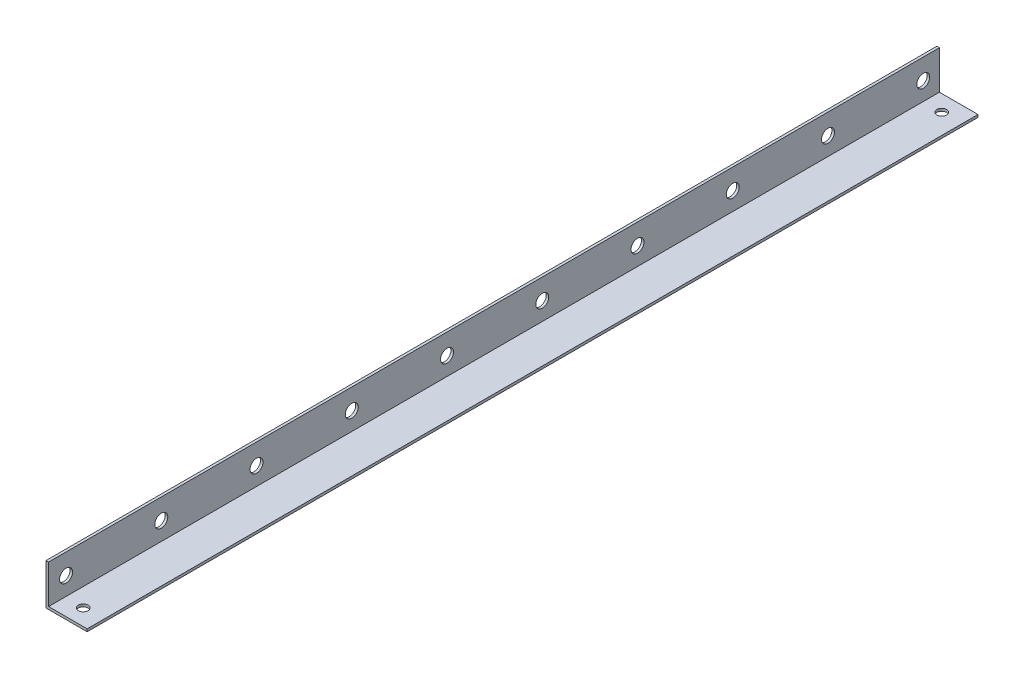
ISO-10303-21;
HEADER;
FILE_DESCRIPTION(('STEP AP214'),'2;1');
FILE_NAME('part.step','',(''),(''),'','','');
FILE_SCHEMA(('AUTOMOTIVE_DESIGN { 1 0 10303 214 1 1 1 1 }'));
ENDSEC;
DATA;
#1=APPLICATION_CONTEXT('core data for automotive mechanical design processes');
#2=APPLICATION_PROTOCOL_DEFINITION('international standard','automotive_design',2000,#1);
#3=PRODUCT_CONTEXT('',#1,'mechanical');
#4=PRODUCT('Part','Part','',(#3));
#5=PRODUCT_RELATED_PRODUCT_CATEGORY('part','',(#4));
#6=PRODUCT_DEFINITION_FORMATION('','',#4);
#7=PRODUCT_DEFINITION_CONTEXT('part definition',#1,'design');
#8=PRODUCT_DEFINITION('design','',#6,#7);
#9=PRODUCT_DEFINITION_SHAPE('','',#8);
#10=(LENGTH_UNIT() NAMED_UNIT(*) SI_UNIT(.MILLI.,.METRE.));
#11=(NAMED_UNIT(*) PLANE_ANGLE_UNIT() SI_UNIT($,.RADIAN.));
#12=(NAMED_UNIT(*) SI_UNIT($,.STERADIAN.) SOLID_ANGLE_UNIT());
#13=UNCERTAINTY_MEASURE_WITH_UNIT(LENGTH_MEASURE(1.E-05),#10,'distance_accuracy_value','');
#14=(GEOMETRIC_REPRESENTATION_CONTEXT(3) GLOBAL_UNCERTAINTY_ASSIGNED_CONTEXT((#13)) GLOBAL_UNIT_ASSIGNED_CONTEXT((#10,
#11,#12)) REPRESENTATION_CONTEXT('',''));
#15=CARTESIAN_POINT('',(0.,0.,0.));
#16=DIRECTION('',(0.,0.,1.));
#17=DIRECTION('',(1.,0.,0.));
#18=AXIS2_PLACEMENT_3D('',#15,#16,#17);
#19=CARTESIAN_POINT('',(1.5875,1.5875,275.));
#20=DIRECTION('',(-1.,0.,0.));
#21=DIRECTION('',(0.,0.,1.));
#22=AXIS2_PLACEMENT_3D('',#19,#20,#21);
#23=PLANE('',#22);
#24=CARTESIAN_POINT('',(1.5875,12.7,-265.));
#25=DIRECTION('',(1.,0.,0.));
#26=DIRECTION('',(0.,0.,-1.));
#27=AXIS2_PLACEMENT_3D('',#24,#25,#26);
#28=CIRCLE('',#27,3.99999999999999);
#29=CARTESIAN_POINT('',(1.5875,12.7,-269.));
#30=VERTEX_POINT('',#29);
#31=EDGE_CURVE('E179',#30,#30,#28,.T.);
#32=ORIENTED_EDGE('',*,*,#31,.F.);
#33=EDGE_LOOP('',(#32));
#34=FACE_BOUND('',#33,.T.);
#35=CARTESIAN_POINT('',(1.5875,12.6999999999996,-206.2));
#36=DIRECTION('',(1.,0.,0.));
#37=DIRECTION('',(0.,0.,-1.));
#38=AXIS2_PLACEMENT_3D('',#35,#36,#37);
#39=CIRCLE('',#38,3.99999999999999);
#40=CARTESIAN_POINT('',(1.5875,12.6999999999996,-210.2));
#41=VERTEX_POINT('',#40);
#42=EDGE_CURVE('E187',#41,#41,#39,.T.);
#43=ORIENTED_EDGE('',*,*,#42,.F.);
#44=EDGE_LOOP('',(#43));
#45=FACE_BOUND('',#44,.T.);
#46=CARTESIAN_POINT('',(1.5875,12.6999999999992,-147.4));
#47=DIRECTION('',(1.,0.,0.));
#48=DIRECTION('',(0.,0.,-1.));
#49=AXIS2_PLACEMENT_3D('',#46,#47,#48);
#50=CIRCLE('',#49,3.99999999999999);
#51=CARTESIAN_POINT('',(1.5875,12.6999999999992,-151.4));
#52=VERTEX_POINT('',#51);
#53=EDGE_CURVE('E195',#52,#52,#50,.T.);
#54=ORIENTED_EDGE('',*,*,#53,.F.);
#55=EDGE_LOOP('',(#54));
#56=FACE_BOUND('',#55,.T.);
#57=CARTESIAN_POINT('',(1.5875,12.6999999999988,-88.6));
#58=DIRECTION('',(1.,0.,0.));
#59=DIRECTION('',(0.,0.,-1.));
#60=AXIS2_PLACEMENT_3D('',#57,#58,#59);
#61=CIRCLE('',#60,3.99999999999999);
#62=CARTESIAN_POINT('',(1.5875,12.6999999999988,-92.6));
#63=VERTEX_POINT('',#62);
#64=EDGE_CURVE('E203',#63,#63,#61,.T.);
#65=ORIENTED_EDGE('',*,*,#64,.F.);
#66=EDGE_LOOP('',(#65));
#67=FACE_BOUND('',#66,.T.);
#68=CARTESIAN_POINT('',(1.5875,12.6999999999984,-29.8));
#69=DIRECTION('',(1.,0.,0.));
#70=DIRECTION('',(0.,0.,-1.));
#71=AXIS2_PLACEMENT_3D('',#68,#69,#70);
#72=CIRCLE('',#71,3.99999999999999);
#73=CARTESIAN_POINT('',(1.5875,12.6999999999984,-33.8));
#74=VERTEX_POINT('',#73);
#75=EDGE_CURVE('E211',#74,#74,#72,.T.);
#76=ORIENTED_EDGE('',*,*,#75,.F.);
#77=EDGE_LOOP('',(#76));
#78=FACE_BOUND('',#77,.T.);
#79=CARTESIAN_POINT('',(1.5875,12.6999999999979,29.));
#80=DIRECTION('',(1.,0.,0.));
#81=DIRECTION('',(0.,0.,-1.));
#82=AXIS2_PLACEMENT_3D('',#79,#80,#81);
#83=CIRCLE('',#82,3.99999999999999);
#84=CARTESIAN_POINT('',(1.5875,12.6999999999979,25.));
#85=VERTEX_POINT('',#84);
#86=EDGE_CURVE('E219',#85,#85,#83,.T.);
#87=ORIENTED_EDGE('',*,*,#86,.F.);
#88=EDGE_LOOP('',(#87));
#89=FACE_BOUND('',#88,.T.);
#90=CARTESIAN_POINT('',(1.5875,12.6999999999975,87.8));
#91=DIRECTION('',(1.,0.,0.));
#92=DIRECTION('',(0.,0.,-1.));
#93=AXIS2_PLACEMENT_3D('',#90,#91,#92);
#94=CIRCLE('',#93,3.99999999999999);
#95=CARTESIAN_POINT('',(1.5875,12.6999999999975,83.8));
#96=VERTEX_POINT('',#95);
#97=EDGE_CURVE('E227',#96,#96,#94,.T.);
#98=ORIENTED_EDGE('',*,*,#97,.F.);
#99=EDGE_LOOP('',(#98));
#100=FACE_BOUND('',#99,.T.);
#101=CARTESIAN_POINT('',(1.5875,12.6999999999971,146.6));
#102=DIRECTION('',(1.,0.,0.));
#103=DIRECTION('',(0.,0.,-1.));
#104=AXIS2_PLACEMENT_3D('',#101,#102,#103);
#105=CIRCLE('',#104,3.99999999999999);
#106=CARTESIAN_POINT('',(1.5875,12.6999999999971,142.6));
#107=VERTEX_POINT('',#106);
#108=EDGE_CURVE('E235',#107,#107,#105,.T.);
#109=ORIENTED_EDGE('',*,*,#108,.F.);
#110=EDGE_LOOP('',(#109));
#111=FACE_BOUND('',#110,.T.);
#112=CARTESIAN_POINT('',(1.5875,12.6999999999967,205.4));
#113=DIRECTION('',(1.,0.,0.));
#114=DIRECTION('',(0.,0.,-1.));
#115=AXIS2_PLACEMENT_3D('',#112,#113,#114);
#116=CIRCLE('',#115,3.99999999999999);
#117=CARTESIAN_POINT('',(1.5875,12.6999999999967,201.4));
#118=VERTEX_POINT('',#117);
#119=EDGE_CURVE('E243',#118,#118,#116,.T.);
#120=ORIENTED_EDGE('',*,*,#119,.F.);
#121=EDGE_LOOP('',(#120));
#122=FACE_BOUND('',#121,.T.);
#123=CARTESIAN_POINT('',(1.5875,12.6999999999963,264.2));
#124=DIRECTION('',(1.,0.,0.));
#125=DIRECTION('',(0.,0.,-1.));
#126=AXIS2_PLACEMENT_3D('',#123,#124,#125);
#127=CIRCLE('',#126,3.99999999999999);
#128=CARTESIAN_POINT('',(1.5875,12.6999999999963,260.2));
#129=VERTEX_POINT('',#128);
#130=EDGE_CURVE('E158',#129,#129,#127,.T.);
#131=ORIENTED_EDGE('',*,*,#130,.F.);
#132=EDGE_LOOP('',(#131));
#133=FACE_BOUND('',#132,.T.);
#134=DIRECTION('',(0.,1.,0.));
#135=VECTOR('',#134,1.);
#136=CARTESIAN_POINT('',(1.5875,1.5875,-275.));
#137=LINE('',#136,#135);
#138=CARTESIAN_POINT('',(1.5875,1.5875,-275.));
#139=VERTEX_POINT('',#138);
#140=CARTESIAN_POINT('',(1.5875,25.4,-275.));
#141=VERTEX_POINT('',#140);
#142=EDGE_CURVE('E129',#139,#141,#137,.T.);
#143=ORIENTED_EDGE('',*,*,#142,.T.);
#144=DIRECTION('',(0.,0.,-1.));
#145=VECTOR('',#144,1.);
#146=CARTESIAN_POINT('',(1.5875,25.4,275.));
#147=LINE('',#146,#145);
#148=CARTESIAN_POINT('',(1.5875,25.4,275.));
#149=VERTEX_POINT('',#148);
#150=EDGE_CURVE('E11',#149,#141,#147,.T.);
#151=ORIENTED_EDGE('',*,*,#150,.F.);
#152=DIRECTION('',(0.,1.,0.));
#153=VECTOR('',#152,1.);
#154=CARTESIAN_POINT('',(1.5875,1.5875,275.));
#155=LINE('',#154,#153);
#156=CARTESIAN_POINT('',(1.5875,1.5875,275.));
#157=VERTEX_POINT('',#156);
#158=EDGE_CURVE('E146',#157,#149,#155,.T.);
#159=ORIENTED_EDGE('',*,*,#158,.F.);
#160=DIRECTION('',(0.,0.,-1.));
#161=VECTOR('',#160,1.);
#162=CARTESIAN_POINT('',(1.5875,1.5875,275.));
#163=LINE('',#162,#161);
#164=EDGE_CURVE('E125',#157,#139,#163,.T.);
#165=ORIENTED_EDGE('',*,*,#164,.T.);
#166=EDGE_LOOP('',(#143,#151,#159,#165));
#167=FACE_BOUND('',#166,.T.);
#168=ADVANCED_FACE('F38',(#34,#45,#56,#67,#78,#89,#100,#111,#122,#133,#167),#23,.F.);
#169=CARTESIAN_POINT('',(0.,25.4,275.));
#170=DIRECTION('',(0.,-1.,0.));
#171=DIRECTION('',(0.,0.,-1.));
#172=AXIS2_PLACEMENT_3D('',#169,#170,#171);
#173=PLANE('',#172);
#174=DIRECTION('',(-1.,0.,0.));
#175=VECTOR('',#174,1.);
#176=CARTESIAN_POINT('',(0.,25.4,-275.));
#177=LINE('',#176,#175);
#178=CARTESIAN_POINT('',(0.,25.4,-275.));
#179=VERTEX_POINT('',#178);
#180=EDGE_CURVE('E133',#141,#179,#177,.T.);
#181=ORIENTED_EDGE('',*,*,#180,.T.);
#182=DIRECTION('',(0.,0.,-1.));
#183=VECTOR('',#182,1.);
#184=CARTESIAN_POINT('',(0.,25.4,275.));
#185=LINE('',#184,#183);
#186=CARTESIAN_POINT('',(0.,25.4,275.));
#187=VERTEX_POINT('',#186);
#188=EDGE_CURVE('E48',#187,#179,#185,.T.);
#189=ORIENTED_EDGE('',*,*,#188,.F.);
#190=DIRECTION('',(-1.,0.,0.));
#191=VECTOR('',#190,1.);
#192=CARTESIAN_POINT('',(0.,25.4,275.));
#193=LINE('',#192,#191);
#194=EDGE_CURVE('E94',#149,#187,#193,.T.);
#195=ORIENTED_EDGE('',*,*,#194,.F.);
#196=ORIENTED_EDGE('',*,*,#150,.T.);
#197=EDGE_LOOP('',(#181,#189,#195,#196));
#198=FACE_BOUND('',#197,.T.);
#199=ADVANCED_FACE('F256',(#198),#173,.F.);
#200=CARTESIAN_POINT('',(0.,0.,275.));
#201=DIRECTION('',(1.,0.,0.));
#202=DIRECTION('',(0.,0.,-1.));
#203=AXIS2_PLACEMENT_3D('',#200,#201,#202);
#204=PLANE('',#203);
#205=CARTESIAN_POINT('',(0.,12.7,-265.));
#206=DIRECTION('',(1.,0.,0.));
#207=DIRECTION('',(0.,0.,-1.));
#208=AXIS2_PLACEMENT_3D('',#205,#206,#207);
#209=CIRCLE('',#208,3.99999999999999);
#210=CARTESIAN_POINT('',(0.,12.7,-269.));
#211=VERTEX_POINT('',#210);
#212=EDGE_CURVE('E134',#211,#211,#209,.T.);
#213=ORIENTED_EDGE('',*,*,#212,.T.);
#214=EDGE_LOOP('',(#213));
#215=FACE_BOUND('',#214,.T.);
#216=CARTESIAN_POINT('',(0.,12.6999999999996,-206.2));
#217=DIRECTION('',(1.,0.,0.));
#218=DIRECTION('',(0.,0.,-1.));
#219=AXIS2_PLACEMENT_3D('',#216,#217,#218);
#220=CIRCLE('',#219,3.99999999999999);
#221=CARTESIAN_POINT('',(0.,12.6999999999996,-210.2));
#222=VERTEX_POINT('',#221);
#223=EDGE_CURVE('E183',#222,#222,#220,.T.);
#224=ORIENTED_EDGE('',*,*,#223,.T.);
#225=EDGE_LOOP('',(#224));
#226=FACE_BOUND('',#225,.T.);
#227=CARTESIAN_POINT('',(0.,12.6999999999992,-147.4));
#228=DIRECTION('',(1.,0.,0.));
#229=DIRECTION('',(0.,0.,-1.));
#230=AXIS2_PLACEMENT_3D('',#227,#228,#229);
#231=CIRCLE('',#230,3.99999999999999);
#232=CARTESIAN_POINT('',(0.,12.6999999999992,-151.4));
#233=VERTEX_POINT('',#232);
#234=EDGE_CURVE('E191',#233,#233,#231,.T.);
#235=ORIENTED_EDGE('',*,*,#234,.T.);
#236=EDGE_LOOP('',(#235));
#237=FACE_BOUND('',#236,.T.);
#238=CARTESIAN_POINT('',(0.,12.6999999999988,-88.6));
#239=DIRECTION('',(1.,0.,0.));
#240=DIRECTION('',(0.,0.,-1.));
#241=AXIS2_PLACEMENT_3D('',#238,#239,#240);
#242=CIRCLE('',#241,3.99999999999999);
#243=CARTESIAN_POINT('',(0.,12.6999999999988,-92.6));
#244=VERTEX_POINT('',#243);
#245=EDGE_CURVE('E199',#244,#244,#242,.T.);
#246=ORIENTED_EDGE('',*,*,#245,.T.);
#247=EDGE_LOOP('',(#246));
#248=FACE_BOUND('',#247,.T.);
#249=CARTESIAN_POINT('',(0.,12.6999999999984,-29.8));
#250=DIRECTION('',(1.,0.,0.));
#251=DIRECTION('',(0.,0.,-1.));
#252=AXIS2_PLACEMENT_3D('',#249,#250,#251);
#253=CIRCLE('',#252,3.99999999999999);
#254=CARTESIAN_POINT('',(0.,12.6999999999984,-33.8));
#255=VERTEX_POINT('',#254);
#256=EDGE_CURVE('E207',#255,#255,#253,.T.);
#257=ORIENTED_EDGE('',*,*,#256,.T.);
#258=EDGE_LOOP('',(#257));
#259=FACE_BOUND('',#258,.T.);
#260=CARTESIAN_POINT('',(0.,12.6999999999979,29.));
#261=DIRECTION('',(1.,0.,0.));
#262=DIRECTION('',(0.,0.,-1.));
#263=AXIS2_PLACEMENT_3D('',#260,#261,#262);
#264=CIRCLE('',#263,3.99999999999999);
#265=CARTESIAN_POINT('',(0.,12.6999999999979,25.));
#266=VERTEX_POINT('',#265);
#267=EDGE_CURVE('E215',#266,#266,#264,.T.);
#268=ORIENTED_EDGE('',*,*,#267,.T.);
#269=EDGE_LOOP('',(#268));
#270=FACE_BOUND('',#269,.T.);
#271=CARTESIAN_POINT('',(0.,12.6999999999975,87.8));
#272=DIRECTION('',(1.,0.,0.));
#273=DIRECTION('',(0.,0.,-1.));
#274=AXIS2_PLACEMENT_3D('',#271,#272,#273);
#275=CIRCLE('',#274,3.99999999999999);
#276=CARTESIAN_POINT('',(0.,12.6999999999975,83.8));
#277=VERTEX_POINT('',#276);
#278=EDGE_CURVE('E223',#277,#277,#275,.T.);
#279=ORIENTED_EDGE('',*,*,#278,.T.);
#280=EDGE_LOOP('',(#279));
#281=FACE_BOUND('',#280,.T.);
#282=CARTESIAN_POINT('',(0.,12.6999999999971,146.6));
#283=DIRECTION('',(1.,0.,0.));
#284=DIRECTION('',(0.,0.,-1.));
#285=AXIS2_PLACEMENT_3D('',#282,#283,#284);
#286=CIRCLE('',#285,3.99999999999999);
#287=CARTESIAN_POINT('',(0.,12.6999999999971,142.6));
#288=VERTEX_POINT('',#287);
#289=EDGE_CURVE('E231',#288,#288,#286,.T.);
#290=ORIENTED_EDGE('',*,*,#289,.T.);
#291=EDGE_LOOP('',(#290));
#292=FACE_BOUND('',#291,.T.);
#293=CARTESIAN_POINT('',(0.,12.6999999999967,205.4));
#294=DIRECTION('',(1.,0.,0.));
#295=DIRECTION('',(0.,0.,-1.));
#296=AXIS2_PLACEMENT_3D('',#293,#294,#295);
#297=CIRCLE('',#296,3.99999999999999);
#298=CARTESIAN_POINT('',(0.,12.6999999999967,201.4));
#299=VERTEX_POINT('',#298);
#300=EDGE_CURVE('E239',#299,#299,#297,.T.);
#301=ORIENTED_EDGE('',*,*,#300,.T.);
#302=EDGE_LOOP('',(#301));
#303=FACE_BOUND('',#302,.T.);
#304=CARTESIAN_POINT('',(0.,12.6999999999963,264.2));
#305=DIRECTION('',(1.,0.,0.));
#306=DIRECTION('',(0.,0.,-1.));
#307=AXIS2_PLACEMENT_3D('',#304,#305,#306);
#308=CIRCLE('',#307,3.99999999999999);
#309=CARTESIAN_POINT('',(0.,12.6999999999963,260.2));
#310=VERTEX_POINT('',#309);
#311=EDGE_CURVE('E165',#310,#310,#308,.T.);
#312=ORIENTED_EDGE('',*,*,#311,.T.);
#313=EDGE_LOOP('',(#312));
#314=FACE_BOUND('',#313,.T.);
#315=DIRECTION('',(0.,-1.,0.));
#316=VECTOR('',#315,1.);
#317=CARTESIAN_POINT('',(0.,0.,-275.));
#318=LINE('',#317,#316);
#319=CARTESIAN_POINT('',(0.,0.,-275.));
#320=VERTEX_POINT('',#319);
#321=EDGE_CURVE('E137',#179,#320,#318,.T.);
#322=ORIENTED_EDGE('',*,*,#321,.T.);
#323=DIRECTION('',(0.,0.,-1.));
#324=VECTOR('',#323,1.);
#325=CARTESIAN_POINT('',(0.,0.,275.));
#326=LINE('',#325,#324);
#327=CARTESIAN_POINT('',(0.,0.,275.));
#328=VERTEX_POINT('',#327);
#329=EDGE_CURVE('E118',#328,#320,#326,.T.);
#330=ORIENTED_EDGE('',*,*,#329,.F.);
#331=DIRECTION('',(0.,-1.,0.));
#332=VECTOR('',#331,1.);
#333=CARTESIAN_POINT('',(0.,0.,275.));
#334=LINE('',#333,#332);
#335=EDGE_CURVE('E107',#187,#328,#334,.T.);
#336=ORIENTED_EDGE('',*,*,#335,.F.);
#337=ORIENTED_EDGE('',*,*,#188,.T.);
#338=EDGE_LOOP('',(#322,#330,#336,#337));
#339=FACE_BOUND('',#338,.T.);
#340=ADVANCED_FACE('F259',(#215,#226,#237,#248,#259,#270,#281,#292,#303,#314,#339),#204,.F.);
#341=CARTESIAN_POINT('',(0.,0.,275.));
#342=DIRECTION('',(0.,1.,0.));
#343=DIRECTION('',(0.,0.,1.));
#344=AXIS2_PLACEMENT_3D('',#341,#342,#343);
#345=PLANE('',#344);
#346=CARTESIAN_POINT('',(13.,0.,265.));
#347=DIRECTION('',(0.,-1.,0.));
#348=DIRECTION('',(0.,0.,-1.));
#349=AXIS2_PLACEMENT_3D('',#346,#347,#348);
#350=CIRCLE('',#349,3.);
#351=CARTESIAN_POINT('',(13.,0.,262.));
#352=VERTEX_POINT('',#351);
#353=EDGE_CURVE('E173',#352,#352,#350,.T.);
#354=ORIENTED_EDGE('',*,*,#353,.F.);
#355=EDGE_LOOP('',(#354));
#356=FACE_BOUND('',#355,.T.);
#357=CARTESIAN_POINT('',(13.,0.,-265.));
#358=DIRECTION('',(0.,1.,0.));
#359=DIRECTION('',(0.,0.,1.));
#360=AXIS2_PLACEMENT_3D('',#357,#358,#359);
#361=CIRCLE('',#360,3.);
#362=CARTESIAN_POINT('',(13.,0.,-262.));
#363=VERTEX_POINT('',#362);
#364=EDGE_CURVE('E159',#363,#363,#361,.T.);
#365=ORIENTED_EDGE('',*,*,#364,.T.);
#366=EDGE_LOOP('',(#365));
#367=FACE_BOUND('',#366,.T.);
#368=DIRECTION('',(1.,0.,0.));
#369=VECTOR('',#368,1.);
#370=CARTESIAN_POINT('',(0.,0.,-275.));
#371=LINE('',#370,#369);
#372=CARTESIAN_POINT('',(25.4,0.,-275.));
#373=VERTEX_POINT('',#372);
#374=EDGE_CURVE('E116',#320,#373,#371,.T.);
#375=ORIENTED_EDGE('',*,*,#374,.T.);
#376=DIRECTION('',(0.,0.,-1.));
#377=VECTOR('',#376,1.);
#378=CARTESIAN_POINT('',(25.4,0.,275.));
#379=LINE('',#378,#377);
#380=CARTESIAN_POINT('',(25.4,0.,275.));
#381=VERTEX_POINT('',#380);
#382=EDGE_CURVE('E113',#381,#373,#379,.T.);
#383=ORIENTED_EDGE('',*,*,#382,.F.);
#384=DIRECTION('',(1.,0.,0.));
#385=VECTOR('',#384,1.);
#386=CARTESIAN_POINT('',(0.,0.,275.));
#387=LINE('',#386,#385);
#388=EDGE_CURVE('E101',#328,#381,#387,.T.);
#389=ORIENTED_EDGE('',*,*,#388,.F.);
#390=ORIENTED_EDGE('',*,*,#329,.T.);
#391=EDGE_LOOP('',(#375,#383,#389,#390));
#392=FACE_BOUND('',#391,.T.);
#393=ADVANCED_FACE('F114',(#356,#367,#392),#345,.F.);
#394=CARTESIAN_POINT('',(25.4,1.5875,275.));
#395=DIRECTION('',(-1.,0.,0.));
#396=DIRECTION('',(0.,0.,1.));
#397=AXIS2_PLACEMENT_3D('',#394,#395,#396);
#398=PLANE('',#397);
#399=DIRECTION('',(0.,1.,0.));
#400=VECTOR('',#399,1.);
#401=CARTESIAN_POINT('',(25.4,1.5875,-275.));
#402=LINE('',#401,#400);
#403=CARTESIAN_POINT('',(25.4,1.5875,-275.));
#404=VERTEX_POINT('',#403);
#405=EDGE_CURVE('E80',#373,#404,#402,.T.);
#406=ORIENTED_EDGE('',*,*,#405,.T.);
#407=DIRECTION('',(0.,0.,-1.));
#408=VECTOR('',#407,1.);
#409=CARTESIAN_POINT('',(25.4,1.5875,275.));
#410=LINE('',#409,#408);
#411=CARTESIAN_POINT('',(25.4,1.5875,275.));
#412=VERTEX_POINT('',#411);
#413=EDGE_CURVE('E119',#412,#404,#410,.T.);
#414=ORIENTED_EDGE('',*,*,#413,.F.);
#415=DIRECTION('',(0.,1.,0.));
#416=VECTOR('',#415,1.);
#417=CARTESIAN_POINT('',(25.4,1.5875,275.));
#418=LINE('',#417,#416);
#419=EDGE_CURVE('E105',#381,#412,#418,.T.);
#420=ORIENTED_EDGE('',*,*,#419,.F.);
#421=ORIENTED_EDGE('',*,*,#382,.T.);
#422=EDGE_LOOP('',(#406,#414,#420,#421));
#423=FACE_BOUND('',#422,.T.);
#424=ADVANCED_FACE('F121',(#423),#398,.F.);
#425=CARTESIAN_POINT('',(1.5875,1.5875,275.));
#426=DIRECTION('',(0.,-1.,0.));
#427=DIRECTION('',(0.,0.,-1.));
#428=AXIS2_PLACEMENT_3D('',#425,#426,#427);
#429=PLANE('',#428);
#430=CARTESIAN_POINT('',(13.,1.5875,265.));
#431=DIRECTION('',(0.,-1.,0.));
#432=DIRECTION('',(0.,0.,-1.));
#433=AXIS2_PLACEMENT_3D('',#430,#431,#432);
#434=CIRCLE('',#433,3.);
#435=CARTESIAN_POINT('',(13.,1.5875,262.));
#436=VERTEX_POINT('',#435);
#437=EDGE_CURVE('E41',#436,#436,#434,.T.);
#438=ORIENTED_EDGE('',*,*,#437,.T.);
#439=EDGE_LOOP('',(#438));
#440=FACE_BOUND('',#439,.T.);
#441=CARTESIAN_POINT('',(13.,1.5875,-265.));
#442=DIRECTION('',(0.,-1.,0.));
#443=DIRECTION('',(0.,0.,-1.));
#444=AXIS2_PLACEMENT_3D('',#441,#442,#443);
#445=CIRCLE('',#444,3.);
#446=CARTESIAN_POINT('',(13.,1.5875,-268.));
#447=VERTEX_POINT('',#446);
#448=EDGE_CURVE('E155',#447,#447,#445,.F.);
#449=ORIENTED_EDGE('',*,*,#448,.F.);
#450=EDGE_LOOP('',(#449));
#451=FACE_BOUND('',#450,.T.);
#452=DIRECTION('',(-1.,0.,0.));
#453=VECTOR('',#452,1.);
#454=CARTESIAN_POINT('',(1.5875,1.5875,-275.));
#455=LINE('',#454,#453);
#456=EDGE_CURVE('E86',#404,#139,#455,.T.);
#457=ORIENTED_EDGE('',*,*,#456,.T.);
#458=ORIENTED_EDGE('',*,*,#164,.F.);
#459=DIRECTION('',(-1.,0.,0.));
#460=VECTOR('',#459,1.);
#461=CARTESIAN_POINT('',(1.5875,1.5875,275.));
#462=LINE('',#461,#460);
#463=EDGE_CURVE('E57',#412,#157,#462,.T.);
#464=ORIENTED_EDGE('',*,*,#463,.F.);
#465=ORIENTED_EDGE('',*,*,#413,.T.);
#466=EDGE_LOOP('',(#457,#458,#464,#465));
#467=FACE_BOUND('',#466,.T.);
#468=ADVANCED_FACE('F264',(#440,#451,#467),#429,.F.);
#469=CARTESIAN_POINT('',(0.,0.,275.));
#470=DIRECTION('',(0.,0.,-1.));
#471=DIRECTION('',(-1.,0.,0.));
#472=AXIS2_PLACEMENT_3D('',#469,#470,#471);
#473=PLANE('',#472);
#474=ORIENTED_EDGE('',*,*,#158,.T.);
#475=ORIENTED_EDGE('',*,*,#194,.T.);
#476=ORIENTED_EDGE('',*,*,#335,.T.);
#477=ORIENTED_EDGE('',*,*,#388,.T.);
#478=ORIENTED_EDGE('',*,*,#419,.T.);
#479=ORIENTED_EDGE('',*,*,#463,.T.);
#480=EDGE_LOOP('',(#474,#475,#476,#477,#478,#479));
#481=FACE_BOUND('',#480,.T.);
#482=ADVANCED_FACE('F103',(#481),#473,.F.);
#483=CARTESIAN_POINT('',(0.,0.,-275.));
#484=DIRECTION('',(0.,0.,-1.));
#485=DIRECTION('',(-1.,0.,0.));
#486=AXIS2_PLACEMENT_3D('',#483,#484,#485);
#487=PLANE('',#486);
#488=ORIENTED_EDGE('',*,*,#142,.F.);
#489=ORIENTED_EDGE('',*,*,#456,.F.);
#490=ORIENTED_EDGE('',*,*,#405,.F.);
#491=ORIENTED_EDGE('',*,*,#374,.F.);
#492=ORIENTED_EDGE('',*,*,#321,.F.);
#493=ORIENTED_EDGE('',*,*,#180,.F.);
#494=EDGE_LOOP('',(#488,#489,#490,#491,#492,#493));
#495=FACE_BOUND('',#494,.T.);
#496=ADVANCED_FACE('F262',(#495),#487,.T.);
#497=CARTESIAN_POINT('',(0.,12.6999999999963,264.2));
#498=DIRECTION('',(1.,0.,0.));
#499=DIRECTION('',(0.,0.,-1.));
#500=AXIS2_PLACEMENT_3D('',#497,#498,#499);
#501=CYLINDRICAL_SURFACE('',#500,3.99999999999999);
#502=ORIENTED_EDGE('',*,*,#311,.F.);
#503=EDGE_LOOP('',(#502));
#504=FACE_BOUND('',#503,.T.);
#505=ORIENTED_EDGE('',*,*,#130,.T.);
#506=EDGE_LOOP('',(#505));
#507=FACE_BOUND('',#506,.T.);
#508=ADVANCED_FACE('F303',(#504,#507),#501,.F.);
#509=CARTESIAN_POINT('',(0.,12.6999999999967,205.4));
#510=DIRECTION('',(1.,0.,0.));
#511=DIRECTION('',(0.,0.,-1.));
#512=AXIS2_PLACEMENT_3D('',#509,#510,#511);
#513=CYLINDRICAL_SURFACE('',#512,3.99999999999999);
#514=ORIENTED_EDGE('',*,*,#300,.F.);
#515=EDGE_LOOP('',(#514));
#516=FACE_BOUND('',#515,.T.);
#517=ORIENTED_EDGE('',*,*,#119,.T.);
#518=EDGE_LOOP('',(#517));
#519=FACE_BOUND('',#518,.T.);
#520=ADVANCED_FACE('F305',(#516,#519),#513,.F.);
#521=CARTESIAN_POINT('',(0.,12.6999999999971,146.6));
#522=DIRECTION('',(1.,0.,0.));
#523=DIRECTION('',(0.,0.,-1.));
#524=AXIS2_PLACEMENT_3D('',#521,#522,#523);
#525=CYLINDRICAL_SURFACE('',#524,3.99999999999999);
#526=ORIENTED_EDGE('',*,*,#289,.F.);
#527=EDGE_LOOP('',(#526));
#528=FACE_BOUND('',#527,.T.);
#529=ORIENTED_EDGE('',*,*,#108,.T.);
#530=EDGE_LOOP('',(#529));
#531=FACE_BOUND('',#530,.T.);
#532=ADVANCED_FACE('F312',(#528,#531),#525,.F.);
#533=CARTESIAN_POINT('',(0.,12.6999999999975,87.8));
#534=DIRECTION('',(1.,0.,0.));
#535=DIRECTION('',(0.,0.,-1.));
#536=AXIS2_PLACEMENT_3D('',#533,#534,#535);
#537=CYLINDRICAL_SURFACE('',#536,3.99999999999999);
#538=ORIENTED_EDGE('',*,*,#278,.F.);
#539=EDGE_LOOP('',(#538));
#540=FACE_BOUND('',#539,.T.);
#541=ORIENTED_EDGE('',*,*,#97,.T.);
#542=EDGE_LOOP('',(#541));
#543=FACE_BOUND('',#542,.T.);
#544=ADVANCED_FACE('F319',(#540,#543),#537,.F.);
#545=CARTESIAN_POINT('',(0.,12.6999999999979,29.));
#546=DIRECTION('',(1.,0.,0.));
#547=DIRECTION('',(0.,0.,-1.));
#548=AXIS2_PLACEMENT_3D('',#545,#546,#547);
#549=CYLINDRICAL_SURFACE('',#548,3.99999999999999);
#550=ORIENTED_EDGE('',*,*,#267,.F.);
#551=EDGE_LOOP('',(#550));
#552=FACE_BOUND('',#551,.T.);
#553=ORIENTED_EDGE('',*,*,#86,.T.);
#554=EDGE_LOOP('',(#553));
#555=FACE_BOUND('',#554,.T.);
#556=ADVANCED_FACE('F323',(#552,#555),#549,.F.);
#557=CARTESIAN_POINT('',(0.,12.6999999999984,-29.8));
#558=DIRECTION('',(1.,0.,0.));
#559=DIRECTION('',(0.,0.,-1.));
#560=AXIS2_PLACEMENT_3D('',#557,#558,#559);
#561=CYLINDRICAL_SURFACE('',#560,3.99999999999999);
#562=ORIENTED_EDGE('',*,*,#256,.F.);
#563=EDGE_LOOP('',(#562));
#564=FACE_BOUND('',#563,.T.);
#565=ORIENTED_EDGE('',*,*,#75,.T.);
#566=EDGE_LOOP('',(#565));
#567=FACE_BOUND('',#566,.T.);
#568=ADVANCED_FACE('F327',(#564,#567),#561,.F.);
#569=CARTESIAN_POINT('',(0.,12.6999999999988,-88.6));
#570=DIRECTION('',(1.,0.,0.));
#571=DIRECTION('',(0.,0.,-1.));
#572=AXIS2_PLACEMENT_3D('',#569,#570,#571);
#573=CYLINDRICAL_SURFACE('',#572,3.99999999999999);
#574=ORIENTED_EDGE('',*,*,#245,.F.);
#575=EDGE_LOOP('',(#574));
#576=FACE_BOUND('',#575,.T.);
#577=ORIENTED_EDGE('',*,*,#64,.T.);
#578=EDGE_LOOP('',(#577));
#579=FACE_BOUND('',#578,.T.);
#580=ADVANCED_FACE('F331',(#576,#579),#573,.F.);
#581=CARTESIAN_POINT('',(0.,12.6999999999992,-147.4));
#582=DIRECTION('',(1.,0.,0.));
#583=DIRECTION('',(0.,0.,-1.));
#584=AXIS2_PLACEMENT_3D('',#581,#582,#583);
#585=CYLINDRICAL_SURFACE('',#584,3.99999999999999);
#586=ORIENTED_EDGE('',*,*,#234,.F.);
#587=EDGE_LOOP('',(#586));
#588=FACE_BOUND('',#587,.T.);
#589=ORIENTED_EDGE('',*,*,#53,.T.);
#590=EDGE_LOOP('',(#589));
#591=FACE_BOUND('',#590,.T.);
#592=ADVANCED_FACE('F335',(#588,#591),#585,.F.);
#593=CARTESIAN_POINT('',(0.,12.6999999999996,-206.2));
#594=DIRECTION('',(1.,0.,0.));
#595=DIRECTION('',(0.,0.,-1.));
#596=AXIS2_PLACEMENT_3D('',#593,#594,#595);
#597=CYLINDRICAL_SURFACE('',#596,3.99999999999999);
#598=ORIENTED_EDGE('',*,*,#223,.F.);
#599=EDGE_LOOP('',(#598));
#600=FACE_BOUND('',#599,.T.);
#601=ORIENTED_EDGE('',*,*,#42,.T.);
#602=EDGE_LOOP('',(#601));
#603=FACE_BOUND('',#602,.T.);
#604=ADVANCED_FACE('F339',(#600,#603),#597,.F.);
#605=CARTESIAN_POINT('',(0.,12.7,-265.));
#606=DIRECTION('',(1.,0.,0.));
#607=DIRECTION('',(0.,0.,-1.));
#608=AXIS2_PLACEMENT_3D('',#605,#606,#607);
#609=CYLINDRICAL_SURFACE('',#608,3.99999999999999);
#610=ORIENTED_EDGE('',*,*,#212,.F.);
#611=EDGE_LOOP('',(#610));
#612=FACE_BOUND('',#611,.T.);
#613=ORIENTED_EDGE('',*,*,#31,.T.);
#614=EDGE_LOOP('',(#613));
#615=FACE_BOUND('',#614,.T.);
#616=ADVANCED_FACE('F343',(#612,#615),#609,.F.);
#617=CARTESIAN_POINT('',(13.,25.4,-265.));
#618=DIRECTION('',(0.,-1.,0.));
#619=DIRECTION('',(0.,0.,-1.));
#620=AXIS2_PLACEMENT_3D('',#617,#618,#619);
#621=CYLINDRICAL_SURFACE('',#620,3.);
#622=ORIENTED_EDGE('',*,*,#364,.F.);
#623=EDGE_LOOP('',(#622));
#624=FACE_BOUND('',#623,.T.);
#625=ORIENTED_EDGE('',*,*,#448,.T.);
#626=EDGE_LOOP('',(#625));
#627=FACE_BOUND('',#626,.T.);
#628=ADVANCED_FACE('F347',(#624,#627),#621,.F.);
#629=CARTESIAN_POINT('',(13.,25.4,265.));
#630=DIRECTION('',(0.,-1.,0.));
#631=DIRECTION('',(0.,0.,-1.));
#632=AXIS2_PLACEMENT_3D('',#629,#630,#631);
#633=CYLINDRICAL_SURFACE('',#632,3.);
#634=ORIENTED_EDGE('',*,*,#353,.T.);
#635=EDGE_LOOP('',(#634));
#636=FACE_BOUND('',#635,.T.);
#637=ORIENTED_EDGE('',*,*,#437,.F.);
#638=EDGE_LOOP('',(#637));
#639=FACE_BOUND('',#638,.T.);
#640=ADVANCED_FACE('F351',(#636,#639),#633,.F.);
#641=CLOSED_SHELL('',(#168,#199,#340,#393,#424,#468,#482,#496,#508,#520,#532,#544,#556,#568,
#580,#592,#604,#616,#628,#640));
#642=MANIFOLD_SOLID_BREP('B2',#641);
#643=ADVANCED_BREP_SHAPE_REPRESENTATION('',(#18,#642),#14);
#644=SHAPE_DEFINITION_REPRESENTATION(#9,#643);
ENDSEC;
END-ISO-10303-21;
